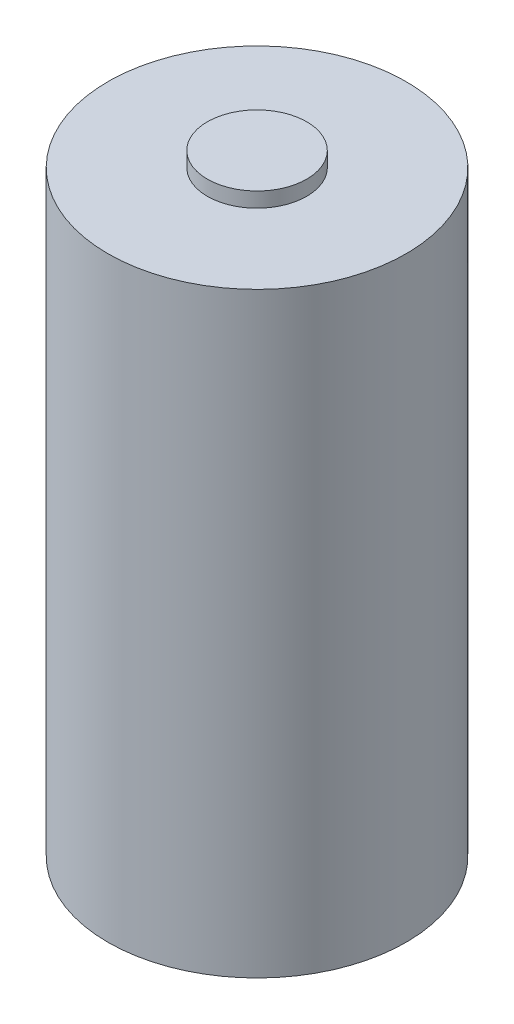
ISO-10303-21;
HEADER;
FILE_DESCRIPTION(('STEP AP214'),'2;1');
FILE_NAME('part.step','',(''),(''),'','','');
FILE_SCHEMA(('AUTOMOTIVE_DESIGN { 1 0 10303 214 1 1 1 1 }'));
ENDSEC;
DATA;
#1=APPLICATION_CONTEXT('core data for automotive mechanical design processes');
#2=APPLICATION_PROTOCOL_DEFINITION('international standard','automotive_design',2000,#1);
#3=PRODUCT_CONTEXT('',#1,'mechanical');
#4=PRODUCT('Part','Part','',(#3));
#5=PRODUCT_RELATED_PRODUCT_CATEGORY('part','',(#4));
#6=PRODUCT_DEFINITION_FORMATION('','',#4);
#7=PRODUCT_DEFINITION_CONTEXT('part definition',#1,'design');
#8=PRODUCT_DEFINITION('design','',#6,#7);
#9=PRODUCT_DEFINITION_SHAPE('','',#8);
#10=(LENGTH_UNIT() NAMED_UNIT(*) SI_UNIT(.MILLI.,.METRE.));
#11=(NAMED_UNIT(*) PLANE_ANGLE_UNIT() SI_UNIT($,.RADIAN.));
#12=(NAMED_UNIT(*) SI_UNIT($,.STERADIAN.) SOLID_ANGLE_UNIT());
#13=UNCERTAINTY_MEASURE_WITH_UNIT(LENGTH_MEASURE(1.E-05),#10,'distance_accuracy_value','');
#14=(GEOMETRIC_REPRESENTATION_CONTEXT(3) GLOBAL_UNCERTAINTY_ASSIGNED_CONTEXT((#13)) GLOBAL_UNIT_ASSIGNED_CONTEXT((#10,
#11,#12)) REPRESENTATION_CONTEXT('',''));
#15=CARTESIAN_POINT('',(0.,0.,0.));
#16=DIRECTION('',(0.,0.,1.));
#17=DIRECTION('',(1.,0.,0.));
#18=AXIS2_PLACEMENT_3D('',#15,#16,#17);
#19=CARTESIAN_POINT('',(0.,12.,0.));
#20=DIRECTION('',(0.,-1.,0.));
#21=DIRECTION('',(0.,0.,-1.));
#22=AXIS2_PLACEMENT_3D('',#19,#20,#21);
#23=CYLINDRICAL_SURFACE('',#22,3.);
#24=CARTESIAN_POINT('',(0.,12.,0.));
#25=DIRECTION('',(0.,1.,0.));
#26=DIRECTION('',(0.,0.,1.));
#27=AXIS2_PLACEMENT_3D('',#24,#25,#26);
#28=CIRCLE('',#27,3.);
#29=CARTESIAN_POINT('',(0.,12.,3.));
#30=VERTEX_POINT('',#29);
#31=EDGE_CURVE('E10',#30,#30,#28,.T.);
#32=ORIENTED_EDGE('',*,*,#31,.F.);
#33=EDGE_LOOP('',(#32));
#34=FACE_BOUND('',#33,.T.);
#35=CARTESIAN_POINT('',(0.,0.,0.));
#36=DIRECTION('',(0.,1.,0.));
#37=DIRECTION('',(0.,0.,1.));
#38=AXIS2_PLACEMENT_3D('',#35,#36,#37);
#39=CIRCLE('',#38,3.);
#40=CARTESIAN_POINT('',(0.,0.,3.));
#41=VERTEX_POINT('',#40);
#42=EDGE_CURVE('E35',#41,#41,#39,.T.);
#43=ORIENTED_EDGE('',*,*,#42,.T.);
#44=EDGE_LOOP('',(#43));
#45=FACE_BOUND('',#44,.T.);
#46=ADVANCED_FACE('F32',(#34,#45),#23,.T.);
#47=CARTESIAN_POINT('',(0.,12.,0.));
#48=DIRECTION('',(0.,1.,0.));
#49=DIRECTION('',(0.,0.,1.));
#50=AXIS2_PLACEMENT_3D('',#47,#48,#49);
#51=PLANE('',#50);
#52=CARTESIAN_POINT('',(0.,12.,0.));
#53=DIRECTION('',(0.,1.,0.));
#54=DIRECTION('',(0.,0.,1.));
#55=AXIS2_PLACEMENT_3D('',#52,#53,#54);
#56=CIRCLE('',#55,1.);
#57=CARTESIAN_POINT('',(0.,12.,1.));
#58=VERTEX_POINT('',#57);
#59=EDGE_CURVE('E44',#58,#58,#56,.T.);
#60=ORIENTED_EDGE('',*,*,#59,.F.);
#61=EDGE_LOOP('',(#60));
#62=FACE_BOUND('',#61,.T.);
#63=ORIENTED_EDGE('',*,*,#31,.T.);
#64=EDGE_LOOP('',(#63));
#65=FACE_BOUND('',#64,.T.);
#66=ADVANCED_FACE('F75',(#62,#65),#51,.T.);
#67=CARTESIAN_POINT('',(0.,0.,0.));
#68=DIRECTION('',(0.,1.,0.));
#69=DIRECTION('',(0.,0.,1.));
#70=AXIS2_PLACEMENT_3D('',#67,#68,#69);
#71=PLANE('',#70);
#72=CARTESIAN_POINT('',(0.,0.,2.));
#73=DIRECTION('',(0.,-1.,0.));
#74=DIRECTION('',(0.,0.,-1.));
#75=AXIS2_PLACEMENT_3D('',#72,#73,#74);
#76=CIRCLE('',#75,0.25);
#77=CARTESIAN_POINT('',(0.,0.,1.75));
#78=VERTEX_POINT('',#77);
#79=EDGE_CURVE('E56',#78,#78,#76,.T.);
#80=ORIENTED_EDGE('',*,*,#79,.F.);
#81=EDGE_LOOP('',(#80));
#82=FACE_BOUND('',#81,.T.);
#83=CARTESIAN_POINT('',(0.,0.,-2.));
#84=DIRECTION('',(0.,-1.,0.));
#85=DIRECTION('',(0.,0.,-1.));
#86=AXIS2_PLACEMENT_3D('',#83,#84,#85);
#87=CIRCLE('',#86,0.25);
#88=CARTESIAN_POINT('',(0.,0.,-2.25));
#89=VERTEX_POINT('',#88);
#90=EDGE_CURVE('E50',#89,#89,#87,.T.);
#91=ORIENTED_EDGE('',*,*,#90,.F.);
#92=EDGE_LOOP('',(#91));
#93=FACE_BOUND('',#92,.T.);
#94=ORIENTED_EDGE('',*,*,#42,.F.);
#95=EDGE_LOOP('',(#94));
#96=FACE_BOUND('',#95,.T.);
#97=ADVANCED_FACE('F71',(#82,#93,#96),#71,.F.);
#98=CARTESIAN_POINT('',(0.,12.3,0.));
#99=DIRECTION('',(0.,-1.,0.));
#100=DIRECTION('',(0.,0.,-1.));
#101=AXIS2_PLACEMENT_3D('',#98,#99,#100);
#102=CYLINDRICAL_SURFACE('',#101,1.);
#103=CARTESIAN_POINT('',(0.,12.3,0.));
#104=DIRECTION('',(0.,1.,0.));
#105=DIRECTION('',(0.,0.,1.));
#106=AXIS2_PLACEMENT_3D('',#103,#104,#105);
#107=CIRCLE('',#106,1.);
#108=CARTESIAN_POINT('',(0.,12.3,1.));
#109=VERTEX_POINT('',#108);
#110=EDGE_CURVE('E42',#109,#109,#107,.T.);
#111=ORIENTED_EDGE('',*,*,#110,.F.);
#112=EDGE_LOOP('',(#111));
#113=FACE_BOUND('',#112,.T.);
#114=ORIENTED_EDGE('',*,*,#59,.T.);
#115=EDGE_LOOP('',(#114));
#116=FACE_BOUND('',#115,.T.);
#117=ADVANCED_FACE('F74',(#113,#116),#102,.T.);
#118=CARTESIAN_POINT('',(0.,12.3,0.));
#119=DIRECTION('',(0.,1.,0.));
#120=DIRECTION('',(0.,0.,1.));
#121=AXIS2_PLACEMENT_3D('',#118,#119,#120);
#122=PLANE('',#121);
#123=ORIENTED_EDGE('',*,*,#110,.T.);
#124=EDGE_LOOP('',(#123));
#125=FACE_BOUND('',#124,.T.);
#126=ADVANCED_FACE('F94',(#125),#122,.T.);
#127=CARTESIAN_POINT('',(0.,0.1,-2.));
#128=DIRECTION('',(0.,-1.,0.));
#129=DIRECTION('',(0.,0.,-1.));
#130=AXIS2_PLACEMENT_3D('',#127,#128,#129);
#131=CYLINDRICAL_SURFACE('',#130,0.25);
#132=CARTESIAN_POINT('',(0.,0.1,-2.));
#133=DIRECTION('',(0.,-1.,0.));
#134=DIRECTION('',(0.,0.,-1.));
#135=AXIS2_PLACEMENT_3D('',#132,#133,#134);
#136=CIRCLE('',#135,0.25);
#137=CARTESIAN_POINT('',(0.,0.1,-2.25));
#138=VERTEX_POINT('',#137);
#139=EDGE_CURVE('E47',#138,#138,#136,.T.);
#140=ORIENTED_EDGE('',*,*,#139,.F.);
#141=EDGE_LOOP('',(#140));
#142=FACE_BOUND('',#141,.T.);
#143=ORIENTED_EDGE('',*,*,#90,.T.);
#144=EDGE_LOOP('',(#143));
#145=FACE_BOUND('',#144,.T.);
#146=ADVANCED_FACE('F98',(#142,#145),#131,.F.);
#147=CARTESIAN_POINT('',(0.,0.1,-2.));
#148=DIRECTION('',(0.,-1.,0.));
#149=DIRECTION('',(0.,0.,-1.));
#150=AXIS2_PLACEMENT_3D('',#147,#148,#149);
#151=PLANE('',#150);
#152=ORIENTED_EDGE('',*,*,#139,.T.);
#153=EDGE_LOOP('',(#152));
#154=FACE_BOUND('',#153,.T.);
#155=ADVANCED_FACE('F67',(#154),#151,.T.);
#156=CARTESIAN_POINT('',(0.,0.1,2.));
#157=DIRECTION('',(0.,-1.,0.));
#158=DIRECTION('',(0.,0.,-1.));
#159=AXIS2_PLACEMENT_3D('',#156,#157,#158);
#160=CYLINDRICAL_SURFACE('',#159,0.25);
#161=CARTESIAN_POINT('',(0.,0.1,2.));
#162=DIRECTION('',(0.,-1.,0.));
#163=DIRECTION('',(0.,0.,-1.));
#164=AXIS2_PLACEMENT_3D('',#161,#162,#163);
#165=CIRCLE('',#164,0.25);
#166=CARTESIAN_POINT('',(0.,0.1,1.75));
#167=VERTEX_POINT('',#166);
#168=EDGE_CURVE('E53',#167,#167,#165,.T.);
#169=ORIENTED_EDGE('',*,*,#168,.F.);
#170=EDGE_LOOP('',(#169));
#171=FACE_BOUND('',#170,.T.);
#172=ORIENTED_EDGE('',*,*,#79,.T.);
#173=EDGE_LOOP('',(#172));
#174=FACE_BOUND('',#173,.T.);
#175=ADVANCED_FACE('F64',(#171,#174),#160,.F.);
#176=CARTESIAN_POINT('',(0.,0.1,2.));
#177=DIRECTION('',(0.,-1.,0.));
#178=DIRECTION('',(0.,0.,-1.));
#179=AXIS2_PLACEMENT_3D('',#176,#177,#178);
#180=PLANE('',#179);
#181=ORIENTED_EDGE('',*,*,#168,.T.);
#182=EDGE_LOOP('',(#181));
#183=FACE_BOUND('',#182,.T.);
#184=ADVANCED_FACE('F62',(#183),#180,.T.);
#185=CLOSED_SHELL('',(#46,#66,#97,#117,#126,#146,#155,#175,#184));
#186=MANIFOLD_SOLID_BREP('B2',#185);
#187=ADVANCED_BREP_SHAPE_REPRESENTATION('',(#18,#186),#14);
#188=SHAPE_DEFINITION_REPRESENTATION(#9,#187);
ENDSEC;
END-ISO-10303-21;
